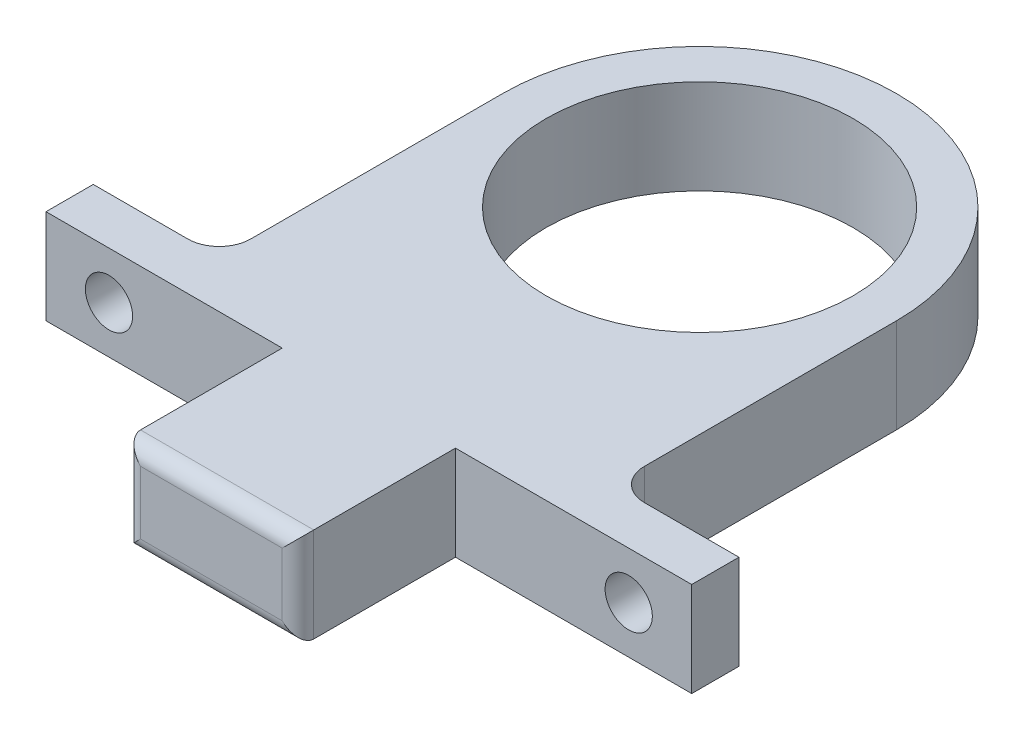
ISO-10303-21;
HEADER;
FILE_DESCRIPTION(('STEP AP214'),'2;1');
FILE_NAME('part.step','',(''),(''),'','','');
FILE_SCHEMA(('AUTOMOTIVE_DESIGN { 1 0 10303 214 1 1 1 1 }'));
ENDSEC;
DATA;
#1=APPLICATION_CONTEXT('core data for automotive mechanical design processes');
#2=APPLICATION_PROTOCOL_DEFINITION('international standard','automotive_design',2000,#1);
#3=PRODUCT_CONTEXT('',#1,'mechanical');
#4=PRODUCT('Part','Part','',(#3));
#5=PRODUCT_RELATED_PRODUCT_CATEGORY('part','',(#4));
#6=PRODUCT_DEFINITION_FORMATION('','',#4);
#7=PRODUCT_DEFINITION_CONTEXT('part definition',#1,'design');
#8=PRODUCT_DEFINITION('design','',#6,#7);
#9=PRODUCT_DEFINITION_SHAPE('','',#8);
#10=(LENGTH_UNIT() NAMED_UNIT(*) SI_UNIT(.MILLI.,.METRE.));
#11=(NAMED_UNIT(*) PLANE_ANGLE_UNIT() SI_UNIT($,.RADIAN.));
#12=(NAMED_UNIT(*) SI_UNIT($,.STERADIAN.) SOLID_ANGLE_UNIT());
#13=UNCERTAINTY_MEASURE_WITH_UNIT(LENGTH_MEASURE(1.E-05),#10,'distance_accuracy_value','');
#14=(GEOMETRIC_REPRESENTATION_CONTEXT(3) GLOBAL_UNCERTAINTY_ASSIGNED_CONTEXT((#13)) GLOBAL_UNIT_ASSIGNED_CONTEXT((#10,
#11,#12)) REPRESENTATION_CONTEXT('',''));
#15=CARTESIAN_POINT('',(0.,0.,0.));
#16=DIRECTION('',(0.,0.,1.));
#17=DIRECTION('',(1.,0.,0.));
#18=AXIS2_PLACEMENT_3D('',#15,#16,#17);
#19=CARTESIAN_POINT('',(14.5,6.,16.));
#20=DIRECTION('',(0.,-1.,0.));
#21=DIRECTION('',(0.,0.,-1.));
#22=AXIS2_PLACEMENT_3D('',#19,#20,#21);
#23=CYLINDRICAL_SURFACE('',#22,2.);
#24=CARTESIAN_POINT('',(14.5,0.763932022500208,18.));
#25=CARTESIAN_POINT('',(14.4360548230811,0.821114452196651,17.999991001011));
#26=CARTESIAN_POINT('',(14.3746747194877,0.880963558778248,17.9969360380857));
#27=CARTESIAN_POINT('',(14.2575309544641,1.00535526899634,17.9861189862143));
#28=CARTESIAN_POINT('',(14.201757724223,1.0698895410455,17.9783650812312));
#29=CARTESIAN_POINT('',(14.0436299233813,1.269403254821,17.9501723427297));
#30=CARTESIAN_POINT('',(13.9500090538812,1.41070634031406,17.9247828447302));
#31=CARTESIAN_POINT('',(13.7964859030759,1.69085008688568,17.8737436355664));
#32=CARTESIAN_POINT('',(13.734085828235,1.8284115592227,17.8483970285937));
#33=CARTESIAN_POINT('',(13.6304231456783,2.11216111679814,17.801968583353));
#34=CARTESIAN_POINT('',(13.5891595639111,2.25834880416089,17.7808865485842));
#35=CARTESIAN_POINT('',(13.5424444149349,2.4900756745183,17.7559694924004));
#36=CARTESIAN_POINT('',(13.5292266928438,2.57373721422762,17.748632542817));
#37=CARTESIAN_POINT('',(13.5099018193217,2.74214941389093,17.7377671781259));
#38=CARTESIAN_POINT('',(13.5037946607241,2.82690007274712,17.7342387591796));
#39=CARTESIAN_POINT('',(13.4988015755461,2.99661169740436,17.731360497232));
#40=CARTESIAN_POINT('',(13.4999096596755,3.08157243027201,17.7320071885158));
#41=CARTESIAN_POINT('',(13.509312145588,3.25095820228575,17.7374022988605));
#42=CARTESIAN_POINT('',(13.5176061598787,3.33538327006965,17.7421504967527));
#43=CARTESIAN_POINT('',(13.5397620052276,3.49240842726077,17.7544457420635));
#44=CARTESIAN_POINT('',(13.5527933449962,3.56516149030752,17.7615661760176));
#45=CARTESIAN_POINT('',(13.584118008221,3.70927623722187,17.7780525456863));
#46=CARTESIAN_POINT('',(13.6024129711344,3.78063748017411,17.7874191808721));
#47=CARTESIAN_POINT('',(13.6650413131257,3.99231248535498,17.8179718344291));
#48=CARTESIAN_POINT('',(13.717093012055,4.13004212413035,17.8415941468649));
#49=CARTESIAN_POINT('',(13.8473106981414,4.41053543180313,17.8919174442979));
#50=CARTESIAN_POINT('',(13.9276616864121,4.55228238725443,17.9186791253345));
#51=CARTESIAN_POINT('',(14.0649005688885,4.75410782817598,17.9526651833944));
#52=CARTESIAN_POINT('',(14.1133615629979,4.81950905689693,17.962958788252));
#53=CARTESIAN_POINT('',(14.2156612628685,4.94638688699547,17.9803633693212));
#54=CARTESIAN_POINT('',(14.2694953446185,5.00786678958472,17.9874770537309));
#55=CARTESIAN_POINT('',(14.3536727958229,5.09640515774771,17.9948357571476));
#56=CARTESIAN_POINT('',(14.382125595261,5.12514571473681,17.9967350315346));
#57=CARTESIAN_POINT('',(14.4402003405923,5.18148166800703,17.9993170113589));
#58=CARTESIAN_POINT('',(14.4698223948428,5.20907695766524,17.9999996037718));
#59=CARTESIAN_POINT('',(14.5,5.23606797749979,18.));
#60=B_SPLINE_CURVE_WITH_KNOTS('',3,(#24,#25,#26,#27,#28,#29,#30,#31,#32,#33,#34,#35,#36,#37,#38,
#39,#40,#41,#42,#43,#44,#45,#46,#47,#48,#49,#50,#51,#52,#53,#54,#55,#56,#57,#58,#59),
.UNSPECIFIED.,.F.,.F.,(4,2,2,2,2,2,2,2,2,2,2,2,2,2,2,2,2,4),(0.,0.257003095036121,
0.513559859167406,1.02485284203966,1.4828396357824,1.94080532182222,2.19552218723163,
2.45023879591204,2.70474399422835,2.95923546951889,3.18175175856397,3.40433742978967,
3.85003679324152,4.34303172260549,4.58891756679051,4.83459359999334,4.95600984354938,
5.07743736555965),.UNSPECIFIED.);
#61=CARTESIAN_POINT('',(14.5,0.763932022500208,18.));
#62=VERTEX_POINT('',#61);
#63=CARTESIAN_POINT('',(14.5,5.23606797749979,18.));
#64=VERTEX_POINT('',#63);
#65=EDGE_CURVE('E165',#62,#64,#60,.T.);
#66=ORIENTED_EDGE('',*,*,#65,.F.);
#67=DIRECTION('',(0.,-1.,0.));
#68=VECTOR('',#67,1.);
#69=CARTESIAN_POINT('',(14.5,6.,18.));
#70=LINE('',#69,#68);
#71=CARTESIAN_POINT('',(14.5,0.,18.));
#72=VERTEX_POINT('',#71);
#73=EDGE_CURVE('E176',#62,#72,#70,.T.);
#74=ORIENTED_EDGE('',*,*,#73,.T.);
#75=CARTESIAN_POINT('',(14.5,0.,16.));
#76=DIRECTION('',(0.,1.,0.));
#77=DIRECTION('',(0.,0.,1.));
#78=AXIS2_PLACEMENT_3D('',#75,#76,#77);
#79=CIRCLE('',#78,2.);
#80=CARTESIAN_POINT('',(12.5,0.,16.));
#81=VERTEX_POINT('',#80);
#82=EDGE_CURVE('E390',#72,#81,#79,.F.);
#83=ORIENTED_EDGE('',*,*,#82,.T.);
#84=DIRECTION('',(0.,-1.,0.));
#85=VECTOR('',#84,1.);
#86=CARTESIAN_POINT('',(12.5,6.,16.));
#87=LINE('',#86,#85);
#88=CARTESIAN_POINT('',(12.5,6.,16.));
#89=VERTEX_POINT('',#88);
#90=EDGE_CURVE('E186',#89,#81,#87,.T.);
#91=ORIENTED_EDGE('',*,*,#90,.F.);
#92=CARTESIAN_POINT('',(14.5,6.,16.));
#93=DIRECTION('',(0.,1.,0.));
#94=DIRECTION('',(0.,0.,1.));
#95=AXIS2_PLACEMENT_3D('',#92,#93,#94);
#96=CIRCLE('',#95,2.);
#97=CARTESIAN_POINT('',(14.5,6.,18.));
#98=VERTEX_POINT('',#97);
#99=EDGE_CURVE('E364',#98,#89,#96,.F.);
#100=ORIENTED_EDGE('',*,*,#99,.F.);
#101=EDGE_CURVE('E179',#98,#64,#70,.T.);
#102=ORIENTED_EDGE('',*,*,#101,.T.);
#103=EDGE_LOOP('',(#66,#74,#83,#91,#100,#102));
#104=FACE_BOUND('',#103,.T.);
#105=ADVANCED_FACE('F35',(#104),#23,.F.);
#106=CARTESIAN_POINT('',(-14.5,6.,16.));
#107=DIRECTION('',(0.,-1.,0.));
#108=DIRECTION('',(0.,0.,-1.));
#109=AXIS2_PLACEMENT_3D('',#106,#107,#108);
#110=CYLINDRICAL_SURFACE('',#109,2.);
#111=DIRECTION('',(0.,-1.,0.));
#112=VECTOR('',#111,1.);
#113=CARTESIAN_POINT('',(-14.5,6.,18.));
#114=LINE('',#113,#112);
#115=CARTESIAN_POINT('',(-14.5,0.76393202250021,18.));
#116=VERTEX_POINT('',#115);
#117=CARTESIAN_POINT('',(-14.5,0.,18.));
#118=VERTEX_POINT('',#117);
#119=EDGE_CURVE('E202',#116,#118,#114,.T.);
#120=ORIENTED_EDGE('',*,*,#119,.F.);
#121=CARTESIAN_POINT('',(-14.5,0.763932022500211,18.));
#122=CARTESIAN_POINT('',(-14.4360548230811,0.821114452196653,17.999991001011));
#123=CARTESIAN_POINT('',(-14.3746747194877,0.88096355877825,17.9969360380857));
#124=CARTESIAN_POINT('',(-14.2575309544641,1.00535526899635,17.9861189862143));
#125=CARTESIAN_POINT('',(-14.201757724223,1.0698895410455,17.9783650812312));
#126=CARTESIAN_POINT('',(-14.0436299233813,1.269403254821,17.9501723427297));
#127=CARTESIAN_POINT('',(-13.9500090538812,1.41070634031406,17.9247828447302));
#128=CARTESIAN_POINT('',(-13.7964859030759,1.69085008688568,17.8737436355664));
#129=CARTESIAN_POINT('',(-13.734085828235,1.8284115592227,17.8483970285937));
#130=CARTESIAN_POINT('',(-13.6304231456783,2.11216111679815,17.801968583353));
#131=CARTESIAN_POINT('',(-13.5891595639111,2.2583488041609,17.7808865485842));
#132=CARTESIAN_POINT('',(-13.5424444149349,2.4900756745183,17.7559694924004));
#133=CARTESIAN_POINT('',(-13.5292266928438,2.57373721422762,17.748632542817));
#134=CARTESIAN_POINT('',(-13.5099018193217,2.74214941389093,17.7377671781259));
#135=CARTESIAN_POINT('',(-13.5037946607241,2.82690007274712,17.7342387591796));
#136=CARTESIAN_POINT('',(-13.4988015755461,2.99661169740436,17.731360497232));
#137=CARTESIAN_POINT('',(-13.4999096596755,3.08157243027202,17.7320071885158));
#138=CARTESIAN_POINT('',(-13.509312145588,3.25095820228576,17.7374022988605));
#139=CARTESIAN_POINT('',(-13.5176061598787,3.33538327006965,17.7421504967527));
#140=CARTESIAN_POINT('',(-13.5397620052276,3.49240842726077,17.7544457420635));
#141=CARTESIAN_POINT('',(-13.5527933449962,3.56516149030752,17.7615661760176));
#142=CARTESIAN_POINT('',(-13.584118008221,3.70927623722188,17.7780525456863));
#143=CARTESIAN_POINT('',(-13.6024129711344,3.78063748017412,17.7874191808721));
#144=CARTESIAN_POINT('',(-13.6650413131257,3.99231248535499,17.8179718344291));
#145=CARTESIAN_POINT('',(-13.717093012055,4.13004212413036,17.8415941468649));
#146=CARTESIAN_POINT('',(-13.8473106981414,4.41053543180314,17.8919174442979));
#147=CARTESIAN_POINT('',(-13.9276616864121,4.55228238725444,17.9186791253345));
#148=CARTESIAN_POINT('',(-14.0649005688885,4.75410782817598,17.9526651833944));
#149=CARTESIAN_POINT('',(-14.1133615629979,4.81950905689693,17.962958788252));
#150=CARTESIAN_POINT('',(-14.2156612628685,4.94638688699547,17.9803633693212));
#151=CARTESIAN_POINT('',(-14.2694953446185,5.00786678958472,17.9874770537309));
#152=CARTESIAN_POINT('',(-14.3536727958229,5.09640515774772,17.9948357571476));
#153=CARTESIAN_POINT('',(-14.382125595261,5.12514571473681,17.9967350315346));
#154=CARTESIAN_POINT('',(-14.4402003405923,5.18148166800703,17.9993170113589));
#155=CARTESIAN_POINT('',(-14.4698223948428,5.20907695766524,17.9999996037718));
#156=CARTESIAN_POINT('',(-14.5,5.23606797749979,18.));
#157=B_SPLINE_CURVE_WITH_KNOTS('',3,(#121,#122,#123,#124,#125,#126,#127,#128,#129,#130,#131,
#132,#133,#134,#135,#136,#137,#138,#139,#140,#141,#142,#143,#144,#145,#146,#147,#148,#149,#150,
#151,#152,#153,#154,#155,#156),.UNSPECIFIED.,.F.,.F.,(4,2,2,2,2,2,2,2,2,2,2,2,2,2,2,2,2,4),(0.,
0.257003095036121,0.513559859167407,1.02485284203966,1.4828396357824,1.94080532182222,
2.19552218723163,2.45023879591204,2.70474399422835,2.95923546951889,3.18175175856396,
3.40433742978967,3.85003679324152,4.34303172260549,4.58891756679051,4.83459359999334,
4.95600984354938,5.07743736555964),.UNSPECIFIED.);
#158=CARTESIAN_POINT('',(-14.5,5.23606797749979,18.));
#159=VERTEX_POINT('',#158);
#160=EDGE_CURVE('E170',#116,#159,#157,.T.);
#161=ORIENTED_EDGE('',*,*,#160,.T.);
#162=CARTESIAN_POINT('',(-14.5,6.,18.));
#163=VERTEX_POINT('',#162);
#164=EDGE_CURVE('E203',#163,#159,#114,.T.);
#165=ORIENTED_EDGE('',*,*,#164,.F.);
#166=CARTESIAN_POINT('',(-14.5,6.,16.));
#167=DIRECTION('',(0.,1.,0.));
#168=DIRECTION('',(0.,0.,1.));
#169=AXIS2_PLACEMENT_3D('',#166,#167,#168);
#170=CIRCLE('',#169,2.);
#171=CARTESIAN_POINT('',(-12.5,6.,16.));
#172=VERTEX_POINT('',#171);
#173=EDGE_CURVE('E349',#163,#172,#170,.T.);
#174=ORIENTED_EDGE('',*,*,#173,.T.);
#175=DIRECTION('',(0.,-1.,0.));
#176=VECTOR('',#175,1.);
#177=CARTESIAN_POINT('',(-12.5,6.,16.));
#178=LINE('',#177,#176);
#179=CARTESIAN_POINT('',(-12.5,0.,16.));
#180=VERTEX_POINT('',#179);
#181=EDGE_CURVE('E206',#172,#180,#178,.T.);
#182=ORIENTED_EDGE('',*,*,#181,.T.);
#183=CARTESIAN_POINT('',(-14.5,0.,16.));
#184=DIRECTION('',(0.,1.,0.));
#185=DIRECTION('',(0.,0.,1.));
#186=AXIS2_PLACEMENT_3D('',#183,#184,#185);
#187=CIRCLE('',#186,2.);
#188=EDGE_CURVE('E375',#118,#180,#187,.T.);
#189=ORIENTED_EDGE('',*,*,#188,.F.);
#190=EDGE_LOOP('',(#120,#161,#165,#174,#182,#189));
#191=FACE_BOUND('',#190,.T.);
#192=ADVANCED_FACE('F272',(#191),#110,.F.);
#193=CARTESIAN_POINT('',(0.,6.,0.));
#194=DIRECTION('',(0.,-1.,0.));
#195=DIRECTION('',(0.,0.,-1.));
#196=AXIS2_PLACEMENT_3D('',#193,#194,#195);
#197=CYLINDRICAL_SURFACE('',#196,9.75);
#198=CARTESIAN_POINT('',(0.,6.,0.));
#199=DIRECTION('',(0.,1.,0.));
#200=DIRECTION('',(0.,0.,1.));
#201=AXIS2_PLACEMENT_3D('',#198,#199,#200);
#202=CIRCLE('',#201,9.75);
#203=CARTESIAN_POINT('',(0.,6.,9.75));
#204=VERTEX_POINT('',#203);
#205=EDGE_CURVE('E189',#204,#204,#202,.T.);
#206=ORIENTED_EDGE('',*,*,#205,.T.);
#207=EDGE_LOOP('',(#206));
#208=FACE_BOUND('',#207,.T.);
#209=CARTESIAN_POINT('',(0.,0.,0.));
#210=DIRECTION('',(0.,1.,0.));
#211=DIRECTION('',(0.,0.,1.));
#212=AXIS2_PLACEMENT_3D('',#209,#210,#211);
#213=CIRCLE('',#212,9.75);
#214=CARTESIAN_POINT('',(0.,0.,9.75));
#215=VERTEX_POINT('',#214);
#216=EDGE_CURVE('E345',#215,#215,#213,.T.);
#217=ORIENTED_EDGE('',*,*,#216,.F.);
#218=EDGE_LOOP('',(#217));
#219=FACE_BOUND('',#218,.T.);
#220=ADVANCED_FACE('F300',(#208,#219),#197,.F.);
#221=CARTESIAN_POINT('',(0.,6.,18.));
#222=DIRECTION('',(0.,0.,1.));
#223=DIRECTION('',(1.,0.,0.));
#224=AXIS2_PLACEMENT_3D('',#221,#222,#223);
#225=PLANE('',#224);
#226=DIRECTION('',(-1.,0.,0.));
#227=VECTOR('',#226,1.);
#228=CARTESIAN_POINT('',(0.,0.,18.));
#229=LINE('',#228,#227);
#230=CARTESIAN_POINT('',(20.5,0.,18.));
#231=VERTEX_POINT('',#230);
#232=EDGE_CURVE('E185',#231,#72,#229,.T.);
#233=ORIENTED_EDGE('',*,*,#232,.T.);
#234=ORIENTED_EDGE('',*,*,#73,.F.);
#235=CARTESIAN_POINT('',(16.5,3.,18.));
#236=DIRECTION('',(0.,0.,-1.));
#237=DIRECTION('',(-1.,0.,0.));
#238=AXIS2_PLACEMENT_3D('',#235,#236,#237);
#239=CIRCLE('',#238,3.);
#240=EDGE_CURVE('E162',#62,#64,#239,.T.);
#241=ORIENTED_EDGE('',*,*,#240,.T.);
#242=ORIENTED_EDGE('',*,*,#101,.F.);
#243=DIRECTION('',(-1.,0.,0.));
#244=VECTOR('',#243,1.);
#245=CARTESIAN_POINT('',(0.,6.,18.));
#246=LINE('',#245,#244);
#247=CARTESIAN_POINT('',(20.5,6.,18.));
#248=VERTEX_POINT('',#247);
#249=EDGE_CURVE('E362',#248,#98,#246,.T.);
#250=ORIENTED_EDGE('',*,*,#249,.F.);
#251=DIRECTION('',(0.,-1.,0.));
#252=VECTOR('',#251,1.);
#253=CARTESIAN_POINT('',(20.5,6.,18.));
#254=LINE('',#253,#252);
#255=EDGE_CURVE('E188',#248,#231,#254,.T.);
#256=ORIENTED_EDGE('',*,*,#255,.T.);
#257=EDGE_LOOP('',(#233,#234,#241,#242,#250,#256));
#258=FACE_BOUND('',#257,.T.);
#259=CARTESIAN_POINT('',(16.5,3.,18.));
#260=DIRECTION('',(0.,0.,1.));
#261=DIRECTION('',(1.,0.,0.));
#262=AXIS2_PLACEMENT_3D('',#259,#260,#261);
#263=CIRCLE('',#262,1.5);
#264=CARTESIAN_POINT('',(18.,3.,18.));
#265=VERTEX_POINT('',#264);
#266=EDGE_CURVE('E222',#265,#265,#263,.T.);
#267=ORIENTED_EDGE('',*,*,#266,.T.);
#268=EDGE_LOOP('',(#267));
#269=FACE_BOUND('',#268,.T.);
#270=ADVANCED_FACE('F182',(#258,#269),#225,.F.);
#271=CARTESIAN_POINT('',(0.,6.,18.));
#272=DIRECTION('',(0.,0.,-1.));
#273=DIRECTION('',(-1.,0.,0.));
#274=AXIS2_PLACEMENT_3D('',#271,#272,#273);
#275=PLANE('',#274);
#276=DIRECTION('',(1.,0.,0.));
#277=VECTOR('',#276,1.);
#278=CARTESIAN_POINT('',(0.,6.,18.));
#279=LINE('',#278,#277);
#280=CARTESIAN_POINT('',(-20.5,6.,18.));
#281=VERTEX_POINT('',#280);
#282=EDGE_CURVE('E329',#281,#163,#279,.T.);
#283=ORIENTED_EDGE('',*,*,#282,.T.);
#284=ORIENTED_EDGE('',*,*,#164,.T.);
#285=CARTESIAN_POINT('',(-16.5,3.,18.));
#286=DIRECTION('',(0.,0.,-1.));
#287=DIRECTION('',(-1.,0.,0.));
#288=AXIS2_PLACEMENT_3D('',#285,#286,#287);
#289=CIRCLE('',#288,3.);
#290=EDGE_CURVE('E171',#159,#116,#289,.T.);
#291=ORIENTED_EDGE('',*,*,#290,.T.);
#292=ORIENTED_EDGE('',*,*,#119,.T.);
#293=DIRECTION('',(1.,0.,0.));
#294=VECTOR('',#293,1.);
#295=CARTESIAN_POINT('',(0.,0.,18.));
#296=LINE('',#295,#294);
#297=CARTESIAN_POINT('',(-20.5,0.,18.));
#298=VERTEX_POINT('',#297);
#299=EDGE_CURVE('E378',#298,#118,#296,.T.);
#300=ORIENTED_EDGE('',*,*,#299,.F.);
#301=DIRECTION('',(0.,-1.,0.));
#302=VECTOR('',#301,1.);
#303=CARTESIAN_POINT('',(-20.5,6.,18.));
#304=LINE('',#303,#302);
#305=EDGE_CURVE('E200',#281,#298,#304,.T.);
#306=ORIENTED_EDGE('',*,*,#305,.F.);
#307=EDGE_LOOP('',(#283,#284,#291,#292,#300,#306));
#308=FACE_BOUND('',#307,.T.);
#309=CARTESIAN_POINT('',(-16.5,3.,18.));
#310=DIRECTION('',(0.,0.,-1.));
#311=DIRECTION('',(-1.,0.,0.));
#312=AXIS2_PLACEMENT_3D('',#309,#310,#311);
#313=CIRCLE('',#312,1.5);
#314=CARTESIAN_POINT('',(-18.,3.,18.));
#315=VERTEX_POINT('',#314);
#316=EDGE_CURVE('E333',#315,#315,#313,.T.);
#317=ORIENTED_EDGE('',*,*,#316,.F.);
#318=EDGE_LOOP('',(#317));
#319=FACE_BOUND('',#318,.T.);
#320=ADVANCED_FACE('F308',(#308,#319),#275,.T.);
#321=CARTESIAN_POINT('',(-12.5,6.,0.));
#322=DIRECTION('',(1.,0.,0.));
#323=DIRECTION('',(0.,0.,-1.));
#324=AXIS2_PLACEMENT_3D('',#321,#322,#323);
#325=PLANE('',#324);
#326=DIRECTION('',(0.,0.,1.));
#327=VECTOR('',#326,1.);
#328=CARTESIAN_POINT('',(-12.5,0.,0.));
#329=LINE('',#328,#327);
#330=CARTESIAN_POINT('',(-12.5,0.,0.));
#331=VERTEX_POINT('',#330);
#332=EDGE_CURVE('E372',#331,#180,#329,.T.);
#333=ORIENTED_EDGE('',*,*,#332,.T.);
#334=ORIENTED_EDGE('',*,*,#181,.F.);
#335=DIRECTION('',(0.,0.,1.));
#336=VECTOR('',#335,1.);
#337=CARTESIAN_POINT('',(-12.5,6.,0.));
#338=LINE('',#337,#336);
#339=CARTESIAN_POINT('',(-12.5,6.,0.));
#340=VERTEX_POINT('',#339);
#341=EDGE_CURVE('E347',#340,#172,#338,.T.);
#342=ORIENTED_EDGE('',*,*,#341,.F.);
#343=DIRECTION('',(0.,-1.,0.));
#344=VECTOR('',#343,1.);
#345=CARTESIAN_POINT('',(-12.5,6.,0.));
#346=LINE('',#345,#344);
#347=EDGE_CURVE('E208',#340,#331,#346,.T.);
#348=ORIENTED_EDGE('',*,*,#347,.T.);
#349=EDGE_LOOP('',(#333,#334,#342,#348));
#350=FACE_BOUND('',#349,.T.);
#351=ADVANCED_FACE('F321',(#350),#325,.F.);
#352=CARTESIAN_POINT('',(0.,6.,0.));
#353=DIRECTION('',(0.,-1.,0.));
#354=DIRECTION('',(0.,0.,-1.));
#355=AXIS2_PLACEMENT_3D('',#352,#353,#354);
#356=CYLINDRICAL_SURFACE('',#355,12.5);
#357=CARTESIAN_POINT('',(0.,0.,0.));
#358=DIRECTION('',(0.,1.,0.));
#359=DIRECTION('',(0.,0.,1.));
#360=AXIS2_PLACEMENT_3D('',#357,#358,#359);
#361=CIRCLE('',#360,12.5);
#362=CARTESIAN_POINT('',(12.5,0.,0.));
#363=VERTEX_POINT('',#362);
#364=EDGE_CURVE('E370',#363,#331,#361,.T.);
#365=ORIENTED_EDGE('',*,*,#364,.T.);
#366=ORIENTED_EDGE('',*,*,#347,.F.);
#367=CARTESIAN_POINT('',(0.,6.,0.));
#368=DIRECTION('',(0.,1.,0.));
#369=DIRECTION('',(0.,0.,1.));
#370=AXIS2_PLACEMENT_3D('',#367,#368,#369);
#371=CIRCLE('',#370,12.5);
#372=CARTESIAN_POINT('',(12.5,6.,0.));
#373=VERTEX_POINT('',#372);
#374=EDGE_CURVE('E344',#373,#340,#371,.T.);
#375=ORIENTED_EDGE('',*,*,#374,.F.);
#376=DIRECTION('',(0.,-1.,0.));
#377=VECTOR('',#376,1.);
#378=CARTESIAN_POINT('',(12.5,6.,0.));
#379=LINE('',#378,#377);
#380=EDGE_CURVE('E211',#373,#363,#379,.T.);
#381=ORIENTED_EDGE('',*,*,#380,.T.);
#382=EDGE_LOOP('',(#365,#366,#375,#381));
#383=FACE_BOUND('',#382,.T.);
#384=ADVANCED_FACE('F325',(#383),#356,.T.);
#385=CARTESIAN_POINT('',(12.5,6.,0.));
#386=DIRECTION('',(1.,0.,0.));
#387=DIRECTION('',(0.,0.,-1.));
#388=AXIS2_PLACEMENT_3D('',#385,#386,#387);
#389=PLANE('',#388);
#390=DIRECTION('',(0.,0.,1.));
#391=VECTOR('',#390,1.);
#392=CARTESIAN_POINT('',(12.5,0.,0.));
#393=LINE('',#392,#391);
#394=EDGE_CURVE('E219',#363,#81,#393,.T.);
#395=ORIENTED_EDGE('',*,*,#394,.F.);
#396=ORIENTED_EDGE('',*,*,#380,.F.);
#397=DIRECTION('',(0.,0.,1.));
#398=VECTOR('',#397,1.);
#399=CARTESIAN_POINT('',(12.5,6.,0.));
#400=LINE('',#399,#398);
#401=EDGE_CURVE('E341',#373,#89,#400,.T.);
#402=ORIENTED_EDGE('',*,*,#401,.T.);
#403=ORIENTED_EDGE('',*,*,#90,.T.);
#404=EDGE_LOOP('',(#395,#396,#402,#403));
#405=FACE_BOUND('',#404,.T.);
#406=ADVANCED_FACE('F318',(#405),#389,.T.);
#407=CARTESIAN_POINT('',(-20.5,6.,0.));
#408=DIRECTION('',(1.,0.,0.));
#409=DIRECTION('',(0.,0.,-1.));
#410=AXIS2_PLACEMENT_3D('',#407,#408,#409);
#411=PLANE('',#410);
#412=DIRECTION('',(0.,0.,1.));
#413=VECTOR('',#412,1.);
#414=CARTESIAN_POINT('',(-20.5,0.,0.));
#415=LINE('',#414,#413);
#416=CARTESIAN_POINT('',(-20.5,0.,21.));
#417=VERTEX_POINT('',#416);
#418=EDGE_CURVE('E380',#298,#417,#415,.T.);
#419=ORIENTED_EDGE('',*,*,#418,.T.);
#420=DIRECTION('',(0.,-1.,0.));
#421=VECTOR('',#420,1.);
#422=CARTESIAN_POINT('',(-20.5,6.,21.));
#423=LINE('',#422,#421);
#424=CARTESIAN_POINT('',(-20.5,6.,21.));
#425=VERTEX_POINT('',#424);
#426=EDGE_CURVE('E197',#425,#417,#423,.T.);
#427=ORIENTED_EDGE('',*,*,#426,.F.);
#428=DIRECTION('',(0.,0.,1.));
#429=VECTOR('',#428,1.);
#430=CARTESIAN_POINT('',(-20.5,6.,0.));
#431=LINE('',#430,#429);
#432=EDGE_CURVE('E353',#281,#425,#431,.T.);
#433=ORIENTED_EDGE('',*,*,#432,.F.);
#434=ORIENTED_EDGE('',*,*,#305,.T.);
#435=EDGE_LOOP('',(#419,#427,#433,#434));
#436=FACE_BOUND('',#435,.T.);
#437=ADVANCED_FACE('F311',(#436),#411,.F.);
#438=CARTESIAN_POINT('',(20.5,6.,0.));
#439=DIRECTION('',(1.,0.,0.));
#440=DIRECTION('',(0.,0.,-1.));
#441=AXIS2_PLACEMENT_3D('',#438,#439,#440);
#442=PLANE('',#441);
#443=DIRECTION('',(0.,0.,1.));
#444=VECTOR('',#443,1.);
#445=CARTESIAN_POINT('',(20.5,0.,0.));
#446=LINE('',#445,#444);
#447=CARTESIAN_POINT('',(20.5,0.,21.));
#448=VERTEX_POINT('',#447);
#449=EDGE_CURVE('E386',#231,#448,#446,.T.);
#450=ORIENTED_EDGE('',*,*,#449,.F.);
#451=ORIENTED_EDGE('',*,*,#255,.F.);
#452=DIRECTION('',(0.,0.,1.));
#453=VECTOR('',#452,1.);
#454=CARTESIAN_POINT('',(20.5,6.,0.));
#455=LINE('',#454,#453);
#456=CARTESIAN_POINT('',(20.5,6.,21.));
#457=VERTEX_POINT('',#456);
#458=EDGE_CURVE('E359',#248,#457,#455,.T.);
#459=ORIENTED_EDGE('',*,*,#458,.T.);
#460=DIRECTION('',(0.,-1.,0.));
#461=VECTOR('',#460,1.);
#462=CARTESIAN_POINT('',(20.5,6.,21.));
#463=LINE('',#462,#461);
#464=EDGE_CURVE('E194',#457,#448,#463,.T.);
#465=ORIENTED_EDGE('',*,*,#464,.T.);
#466=EDGE_LOOP('',(#450,#451,#459,#465));
#467=FACE_BOUND('',#466,.T.);
#468=ADVANCED_FACE('F298',(#467),#442,.T.);
#469=CARTESIAN_POINT('',(0.,0.,0.));
#470=DIRECTION('',(0.,1.,0.));
#471=DIRECTION('',(0.,0.,1.));
#472=AXIS2_PLACEMENT_3D('',#469,#470,#471);
#473=PLANE('',#472);
#474=DIRECTION('',(0.,0.,1.));
#475=VECTOR('',#474,1.);
#476=CARTESIAN_POINT('',(5.5,0.,21.));
#477=LINE('',#476,#475);
#478=CARTESIAN_POINT('',(5.5,0.,21.));
#479=VERTEX_POINT('',#478);
#480=CARTESIAN_POINT('',(5.5,0.,30.));
#481=VERTEX_POINT('',#480);
#482=EDGE_CURVE('E220',#479,#481,#477,.T.);
#483=ORIENTED_EDGE('',*,*,#482,.T.);
#484=DIRECTION('',(1.,0.,0.));
#485=VECTOR('',#484,1.);
#486=CARTESIAN_POINT('',(0.,0.,30.));
#487=LINE('',#486,#485);
#488=CARTESIAN_POINT('',(-5.5,0.,30.));
#489=VERTEX_POINT('',#488);
#490=EDGE_CURVE('E11',#481,#489,#487,.F.);
#491=ORIENTED_EDGE('',*,*,#490,.T.);
#492=DIRECTION('',(0.,0.,1.));
#493=VECTOR('',#492,1.);
#494=CARTESIAN_POINT('',(-5.5,0.,21.));
#495=LINE('',#494,#493);
#496=CARTESIAN_POINT('',(-5.5,0.,21.));
#497=VERTEX_POINT('',#496);
#498=EDGE_CURVE('E217',#497,#489,#495,.T.);
#499=ORIENTED_EDGE('',*,*,#498,.F.);
#500=DIRECTION('',(1.,0.,0.));
#501=VECTOR('',#500,1.);
#502=CARTESIAN_POINT('',(0.,0.,21.));
#503=LINE('',#502,#501);
#504=EDGE_CURVE('E383',#417,#497,#503,.T.);
#505=ORIENTED_EDGE('',*,*,#504,.F.);
#506=ORIENTED_EDGE('',*,*,#418,.F.);
#507=ORIENTED_EDGE('',*,*,#299,.T.);
#508=ORIENTED_EDGE('',*,*,#188,.T.);
#509=ORIENTED_EDGE('',*,*,#332,.F.);
#510=ORIENTED_EDGE('',*,*,#364,.F.);
#511=ORIENTED_EDGE('',*,*,#394,.T.);
#512=ORIENTED_EDGE('',*,*,#82,.F.);
#513=ORIENTED_EDGE('',*,*,#232,.F.);
#514=ORIENTED_EDGE('',*,*,#449,.T.);
#515=EDGE_CURVE('E382',#479,#448,#503,.T.);
#516=ORIENTED_EDGE('',*,*,#515,.F.);
#517=EDGE_LOOP('',(#483,#491,#499,#505,#506,#507,#508,#509,#510,#511,#512,#513,#514,#516));
#518=FACE_BOUND('',#517,.T.);
#519=ORIENTED_EDGE('',*,*,#216,.T.);
#520=EDGE_LOOP('',(#519));
#521=FACE_BOUND('',#520,.T.);
#522=ADVANCED_FACE('F295',(#518,#521),#473,.F.);
#523=CARTESIAN_POINT('',(0.,6.,0.));
#524=DIRECTION('',(0.,1.,0.));
#525=DIRECTION('',(0.,0.,1.));
#526=AXIS2_PLACEMENT_3D('',#523,#524,#525);
#527=PLANE('',#526);
#528=DIRECTION('',(0.,0.,1.));
#529=VECTOR('',#528,1.);
#530=CARTESIAN_POINT('',(-5.5,6.,21.));
#531=LINE('',#530,#529);
#532=CARTESIAN_POINT('',(-5.5,6.,21.));
#533=VERTEX_POINT('',#532);
#534=CARTESIAN_POINT('',(-5.5,6.,30.));
#535=VERTEX_POINT('',#534);
#536=EDGE_CURVE('E216',#533,#535,#531,.T.);
#537=ORIENTED_EDGE('',*,*,#536,.T.);
#538=DIRECTION('',(1.,0.,0.));
#539=VECTOR('',#538,1.);
#540=CARTESIAN_POINT('',(5.5,6.,30.));
#541=LINE('',#540,#539);
#542=CARTESIAN_POINT('',(5.5,6.,30.));
#543=VERTEX_POINT('',#542);
#544=EDGE_CURVE('E59',#535,#543,#541,.T.);
#545=ORIENTED_EDGE('',*,*,#544,.T.);
#546=DIRECTION('',(0.,0.,1.));
#547=VECTOR('',#546,1.);
#548=CARTESIAN_POINT('',(5.5,6.,21.));
#549=LINE('',#548,#547);
#550=CARTESIAN_POINT('',(5.5,6.,21.));
#551=VERTEX_POINT('',#550);
#552=EDGE_CURVE('E214',#551,#543,#549,.T.);
#553=ORIENTED_EDGE('',*,*,#552,.F.);
#554=DIRECTION('',(1.,0.,0.));
#555=VECTOR('',#554,1.);
#556=CARTESIAN_POINT('',(0.,6.,21.));
#557=LINE('',#556,#555);
#558=EDGE_CURVE('E355',#551,#457,#557,.T.);
#559=ORIENTED_EDGE('',*,*,#558,.T.);
#560=ORIENTED_EDGE('',*,*,#458,.F.);
#561=ORIENTED_EDGE('',*,*,#249,.T.);
#562=ORIENTED_EDGE('',*,*,#99,.T.);
#563=ORIENTED_EDGE('',*,*,#401,.F.);
#564=ORIENTED_EDGE('',*,*,#374,.T.);
#565=ORIENTED_EDGE('',*,*,#341,.T.);
#566=ORIENTED_EDGE('',*,*,#173,.F.);
#567=ORIENTED_EDGE('',*,*,#282,.F.);
#568=ORIENTED_EDGE('',*,*,#432,.T.);
#569=EDGE_CURVE('E356',#425,#533,#557,.T.);
#570=ORIENTED_EDGE('',*,*,#569,.T.);
#571=EDGE_LOOP('',(#537,#545,#553,#559,#560,#561,#562,#563,#564,#565,#566,#567,#568,#570));
#572=FACE_BOUND('',#571,.T.);
#573=ORIENTED_EDGE('',*,*,#205,.F.);
#574=EDGE_LOOP('',(#573));
#575=FACE_BOUND('',#574,.T.);
#576=ADVANCED_FACE('F291',(#572,#575),#527,.T.);
#577=CARTESIAN_POINT('',(0.,6.,21.));
#578=DIRECTION('',(0.,0.,-1.));
#579=DIRECTION('',(-1.,0.,0.));
#580=AXIS2_PLACEMENT_3D('',#577,#578,#579);
#581=PLANE('',#580);
#582=CARTESIAN_POINT('',(16.5,3.,21.));
#583=DIRECTION('',(0.,0.,1.));
#584=DIRECTION('',(1.,0.,0.));
#585=AXIS2_PLACEMENT_3D('',#582,#583,#584);
#586=CIRCLE('',#585,1.5);
#587=CARTESIAN_POINT('',(18.,3.,21.));
#588=VERTEX_POINT('',#587);
#589=EDGE_CURVE('E180',#588,#588,#586,.T.);
#590=ORIENTED_EDGE('',*,*,#589,.F.);
#591=EDGE_LOOP('',(#590));
#592=FACE_BOUND('',#591,.T.);
#593=ORIENTED_EDGE('',*,*,#558,.F.);
#594=DIRECTION('',(0.,-1.,0.));
#595=VECTOR('',#594,1.);
#596=CARTESIAN_POINT('',(5.5,6.,21.));
#597=LINE('',#596,#595);
#598=EDGE_CURVE('E213',#551,#479,#597,.T.);
#599=ORIENTED_EDGE('',*,*,#598,.T.);
#600=ORIENTED_EDGE('',*,*,#515,.T.);
#601=ORIENTED_EDGE('',*,*,#464,.F.);
#602=EDGE_LOOP('',(#593,#599,#600,#601));
#603=FACE_BOUND('',#602,.T.);
#604=ADVANCED_FACE('F294',(#592,#603),#581,.F.);
#605=CARTESIAN_POINT('',(-16.5,3.,21.));
#606=DIRECTION('',(0.,0.,1.));
#607=DIRECTION('',(1.,0.,0.));
#608=AXIS2_PLACEMENT_3D('',#605,#606,#607);
#609=CIRCLE('',#608,1.5);
#610=CARTESIAN_POINT('',(-15.,3.,21.));
#611=VERTEX_POINT('',#610);
#612=EDGE_CURVE('E334',#611,#611,#609,.T.);
#613=ORIENTED_EDGE('',*,*,#612,.F.);
#614=EDGE_LOOP('',(#613));
#615=FACE_BOUND('',#614,.T.);
#616=DIRECTION('',(0.,-1.,0.));
#617=VECTOR('',#616,1.);
#618=CARTESIAN_POINT('',(-5.5,6.,21.));
#619=LINE('',#618,#617);
#620=EDGE_CURVE('E225',#533,#497,#619,.T.);
#621=ORIENTED_EDGE('',*,*,#620,.F.);
#622=ORIENTED_EDGE('',*,*,#569,.F.);
#623=ORIENTED_EDGE('',*,*,#426,.T.);
#624=ORIENTED_EDGE('',*,*,#504,.T.);
#625=EDGE_LOOP('',(#621,#622,#623,#624));
#626=FACE_BOUND('',#625,.T.);
#627=ADVANCED_FACE('F315',(#615,#626),#581,.F.);
#628=CARTESIAN_POINT('',(-5.5,6.,31.));
#629=DIRECTION('',(0.,0.,-1.));
#630=DIRECTION('',(-1.,0.,0.));
#631=AXIS2_PLACEMENT_3D('',#628,#629,#630);
#632=PLANE('',#631);
#633=DIRECTION('',(1.,0.,0.));
#634=VECTOR('',#633,1.);
#635=CARTESIAN_POINT('',(-5.5,5.,31.));
#636=LINE('',#635,#634);
#637=CARTESIAN_POINT('',(4.5,5.,31.));
#638=VERTEX_POINT('',#637);
#639=CARTESIAN_POINT('',(-4.5,5.,31.));
#640=VERTEX_POINT('',#639);
#641=EDGE_CURVE('E232',#638,#640,#636,.F.);
#642=ORIENTED_EDGE('',*,*,#641,.T.);
#643=DIRECTION('',(0.,-1.,0.));
#644=VECTOR('',#643,1.);
#645=CARTESIAN_POINT('',(-4.5,6.,31.));
#646=LINE('',#645,#644);
#647=CARTESIAN_POINT('',(-4.5,1.,31.));
#648=VERTEX_POINT('',#647);
#649=EDGE_CURVE('E234',#640,#648,#646,.T.);
#650=ORIENTED_EDGE('',*,*,#649,.T.);
#651=DIRECTION('',(1.,0.,0.));
#652=VECTOR('',#651,1.);
#653=CARTESIAN_POINT('',(-5.5,1.,31.));
#654=LINE('',#653,#652);
#655=CARTESIAN_POINT('',(4.5,1.,31.));
#656=VERTEX_POINT('',#655);
#657=EDGE_CURVE('E227',#648,#656,#654,.T.);
#658=ORIENTED_EDGE('',*,*,#657,.T.);
#659=DIRECTION('',(0.,-1.,0.));
#660=VECTOR('',#659,1.);
#661=CARTESIAN_POINT('',(4.5,6.,31.));
#662=LINE('',#661,#660);
#663=EDGE_CURVE('E230',#656,#638,#662,.F.);
#664=ORIENTED_EDGE('',*,*,#663,.T.);
#665=EDGE_LOOP('',(#642,#650,#658,#664));
#666=FACE_BOUND('',#665,.T.);
#667=ADVANCED_FACE('F448',(#666),#632,.F.);
#668=CARTESIAN_POINT('',(5.5,6.,21.));
#669=DIRECTION('',(1.,0.,0.));
#670=DIRECTION('',(0.,0.,-1.));
#671=AXIS2_PLACEMENT_3D('',#668,#669,#670);
#672=PLANE('',#671);
#673=ORIENTED_EDGE('',*,*,#552,.T.);
#674=DIRECTION('',(0.,-1.,0.));
#675=VECTOR('',#674,1.);
#676=CARTESIAN_POINT('',(5.5,0.,30.));
#677=LINE('',#676,#675);
#678=EDGE_CURVE('E44',#543,#481,#677,.T.);
#679=ORIENTED_EDGE('',*,*,#678,.T.);
#680=ORIENTED_EDGE('',*,*,#482,.F.);
#681=ORIENTED_EDGE('',*,*,#598,.F.);
#682=EDGE_LOOP('',(#673,#679,#680,#681));
#683=FACE_BOUND('',#682,.T.);
#684=ADVANCED_FACE('F445',(#683),#672,.T.);
#685=CARTESIAN_POINT('',(-5.5,6.,21.));
#686=DIRECTION('',(1.,0.,0.));
#687=DIRECTION('',(0.,0.,-1.));
#688=AXIS2_PLACEMENT_3D('',#685,#686,#687);
#689=PLANE('',#688);
#690=ORIENTED_EDGE('',*,*,#498,.T.);
#691=DIRECTION('',(0.,-1.,0.));
#692=VECTOR('',#691,1.);
#693=CARTESIAN_POINT('',(-5.5,6.,30.));
#694=LINE('',#693,#692);
#695=EDGE_CURVE('E237',#489,#535,#694,.F.);
#696=ORIENTED_EDGE('',*,*,#695,.T.);
#697=ORIENTED_EDGE('',*,*,#536,.F.);
#698=ORIENTED_EDGE('',*,*,#620,.T.);
#699=EDGE_LOOP('',(#690,#696,#697,#698));
#700=FACE_BOUND('',#699,.T.);
#701=ADVANCED_FACE('F286',(#700),#689,.F.);
#702=CARTESIAN_POINT('',(-16.5,3.,15.));
#703=DIRECTION('',(0.,0.,1.));
#704=DIRECTION('',(1.,0.,0.));
#705=AXIS2_PLACEMENT_3D('',#702,#703,#704);
#706=CYLINDRICAL_SURFACE('',#705,1.5);
#707=ORIENTED_EDGE('',*,*,#316,.T.);
#708=EDGE_LOOP('',(#707));
#709=FACE_BOUND('',#708,.T.);
#710=ORIENTED_EDGE('',*,*,#612,.T.);
#711=EDGE_LOOP('',(#710));
#712=FACE_BOUND('',#711,.T.);
#713=ADVANCED_FACE('F283',(#709,#712),#706,.F.);
#714=CARTESIAN_POINT('',(16.5,3.,15.));
#715=DIRECTION('',(0.,0.,1.));
#716=DIRECTION('',(1.,0.,0.));
#717=AXIS2_PLACEMENT_3D('',#714,#715,#716);
#718=CYLINDRICAL_SURFACE('',#717,1.5);
#719=ORIENTED_EDGE('',*,*,#589,.T.);
#720=EDGE_LOOP('',(#719));
#721=FACE_BOUND('',#720,.T.);
#722=ORIENTED_EDGE('',*,*,#266,.F.);
#723=EDGE_LOOP('',(#722));
#724=FACE_BOUND('',#723,.T.);
#725=ADVANCED_FACE('F280',(#721,#724),#718,.F.);
#726=CARTESIAN_POINT('',(-16.5,3.,12.));
#727=DIRECTION('',(0.,0.,1.));
#728=DIRECTION('',(1.,0.,0.));
#729=AXIS2_PLACEMENT_3D('',#726,#727,#728);
#730=CYLINDRICAL_SURFACE('',#729,3.);
#731=ORIENTED_EDGE('',*,*,#290,.F.);
#732=ORIENTED_EDGE('',*,*,#160,.F.);
#733=EDGE_LOOP('',(#731,#732));
#734=FACE_BOUND('',#733,.T.);
#735=ADVANCED_FACE('F276',(#734),#730,.F.);
#736=CARTESIAN_POINT('',(16.5,3.,12.));
#737=DIRECTION('',(0.,0.,1.));
#738=DIRECTION('',(1.,0.,0.));
#739=AXIS2_PLACEMENT_3D('',#736,#737,#738);
#740=CYLINDRICAL_SURFACE('',#739,3.);
#741=ORIENTED_EDGE('',*,*,#65,.T.);
#742=ORIENTED_EDGE('',*,*,#240,.F.);
#743=EDGE_LOOP('',(#741,#742));
#744=FACE_BOUND('',#743,.T.);
#745=ADVANCED_FACE('F164',(#744),#740,.F.);
#746=CARTESIAN_POINT('',(4.5,6.,30.));
#747=DIRECTION('',(0.,1.,0.));
#748=DIRECTION('',(0.,0.,1.));
#749=AXIS2_PLACEMENT_3D('',#746,#747,#748);
#750=CYLINDRICAL_SURFACE('',#749,1.);
#751=CARTESIAN_POINT('',(4.5,1.,30.));
#752=DIRECTION('',(0.707106781186547,0.707106781186547,0.));
#753=DIRECTION('',(0.707106781186547,-0.707106781186547,0.));
#754=AXIS2_PLACEMENT_3D('',#751,#752,#753);
#755=ELLIPSE('',#754,1.41421356237309,1.);
#756=EDGE_CURVE('E245',#481,#656,#755,.F.);
#757=ORIENTED_EDGE('',*,*,#756,.F.);
#758=ORIENTED_EDGE('',*,*,#678,.F.);
#759=CARTESIAN_POINT('',(4.5,5.,30.));
#760=DIRECTION('',(-0.707106781186547,0.707106781186547,0.));
#761=DIRECTION('',(0.707106781186547,0.707106781186547,0.));
#762=AXIS2_PLACEMENT_3D('',#759,#760,#761);
#763=ELLIPSE('',#762,1.41421356237309,1.);
#764=EDGE_CURVE('E39',#638,#543,#763,.T.);
#765=ORIENTED_EDGE('',*,*,#764,.F.);
#766=ORIENTED_EDGE('',*,*,#663,.F.);
#767=EDGE_LOOP('',(#757,#758,#765,#766));
#768=FACE_BOUND('',#767,.T.);
#769=ADVANCED_FACE('F37',(#768),#750,.T.);
#770=CARTESIAN_POINT('',(0.,5.,30.));
#771=DIRECTION('',(-1.,0.,0.));
#772=DIRECTION('',(0.,0.,1.));
#773=AXIS2_PLACEMENT_3D('',#770,#771,#772);
#774=CYLINDRICAL_SURFACE('',#773,1.);
#775=ORIENTED_EDGE('',*,*,#764,.T.);
#776=ORIENTED_EDGE('',*,*,#544,.F.);
#777=CARTESIAN_POINT('',(-4.5,5.,30.));
#778=DIRECTION('',(-0.707106781186547,-0.707106781186547,0.));
#779=DIRECTION('',(-0.707106781186547,0.707106781186547,0.));
#780=AXIS2_PLACEMENT_3D('',#777,#778,#779);
#781=ELLIPSE('',#780,1.41421356237309,1.);
#782=EDGE_CURVE('E244',#640,#535,#781,.T.);
#783=ORIENTED_EDGE('',*,*,#782,.F.);
#784=ORIENTED_EDGE('',*,*,#641,.F.);
#785=EDGE_LOOP('',(#775,#776,#783,#784));
#786=FACE_BOUND('',#785,.T.);
#787=ADVANCED_FACE('F455',(#786),#774,.T.);
#788=CARTESIAN_POINT('',(-5.5,1.,30.));
#789=DIRECTION('',(1.,0.,0.));
#790=DIRECTION('',(0.,0.,-1.));
#791=AXIS2_PLACEMENT_3D('',#788,#789,#790);
#792=CYLINDRICAL_SURFACE('',#791,1.);
#793=ORIENTED_EDGE('',*,*,#756,.T.);
#794=ORIENTED_EDGE('',*,*,#657,.F.);
#795=CARTESIAN_POINT('',(-4.5,1.,30.));
#796=DIRECTION('',(0.707106781186547,-0.707106781186547,0.));
#797=DIRECTION('',(0.707106781186547,0.707106781186547,0.));
#798=AXIS2_PLACEMENT_3D('',#795,#796,#797);
#799=ELLIPSE('',#798,1.41421356237309,1.);
#800=EDGE_CURVE('E242',#489,#648,#799,.F.);
#801=ORIENTED_EDGE('',*,*,#800,.F.);
#802=ORIENTED_EDGE('',*,*,#490,.F.);
#803=EDGE_LOOP('',(#793,#794,#801,#802));
#804=FACE_BOUND('',#803,.T.);
#805=ADVANCED_FACE('F415',(#804),#792,.T.);
#806=CARTESIAN_POINT('',(-4.5,6.,30.));
#807=DIRECTION('',(0.,-1.,0.));
#808=DIRECTION('',(0.,0.,-1.));
#809=AXIS2_PLACEMENT_3D('',#806,#807,#808);
#810=CYLINDRICAL_SURFACE('',#809,1.);
#811=ORIENTED_EDGE('',*,*,#782,.T.);
#812=ORIENTED_EDGE('',*,*,#695,.F.);
#813=ORIENTED_EDGE('',*,*,#800,.T.);
#814=ORIENTED_EDGE('',*,*,#649,.F.);
#815=EDGE_LOOP('',(#811,#812,#813,#814));
#816=FACE_BOUND('',#815,.T.);
#817=ADVANCED_FACE('F419',(#816),#810,.T.);
#818=CLOSED_SHELL('',(#105,#192,#220,#270,#320,#351,#384,#406,#437,#468,#522,#576,#604,#627,
#667,#684,#701,#713,#725,#735,#745,#769,#787,#805,#817));
#819=MANIFOLD_SOLID_BREP('B2',#818);
#820=ADVANCED_BREP_SHAPE_REPRESENTATION('',(#18,#819),#14);
#821=SHAPE_DEFINITION_REPRESENTATION(#9,#820);
ENDSEC;
END-ISO-10303-21;
